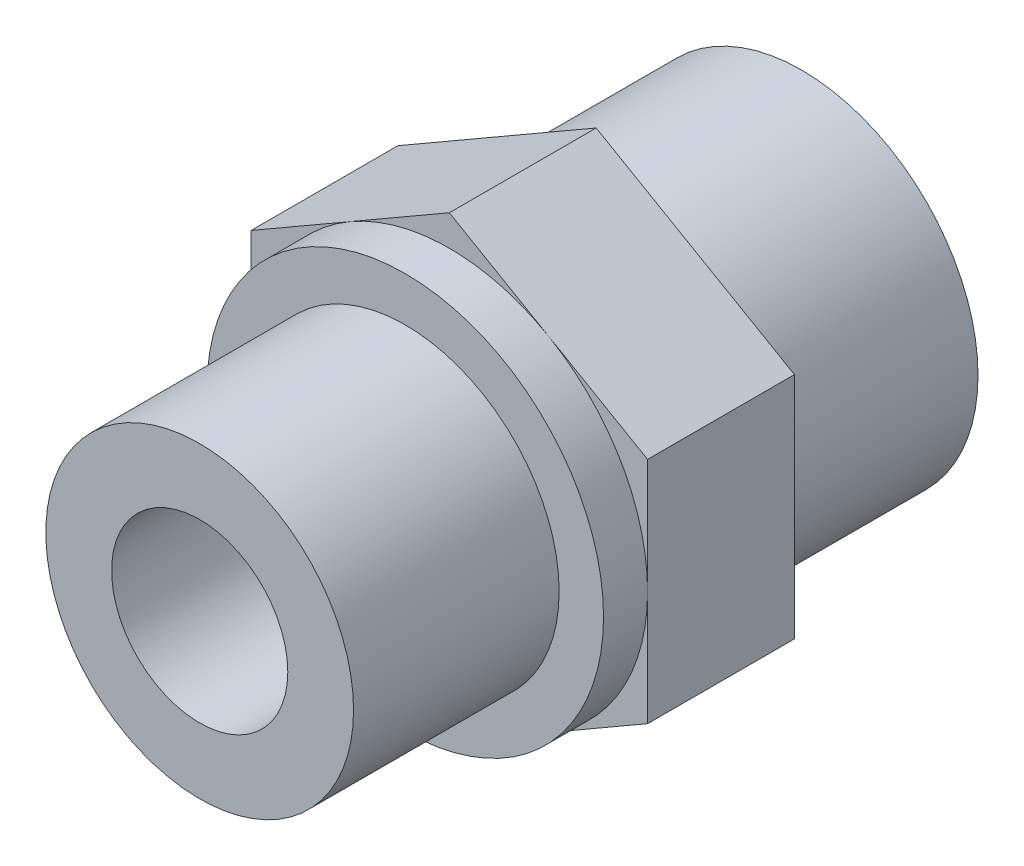
ISO-10303-21;
HEADER;
FILE_DESCRIPTION(('STEP AP214'),'2;1');
FILE_NAME('part.step','',(''),(''),'','','');
FILE_SCHEMA(('AUTOMOTIVE_DESIGN { 1 0 10303 214 1 1 1 1 }'));
ENDSEC;
DATA;
#1=APPLICATION_CONTEXT('core data for automotive mechanical design processes');
#2=APPLICATION_PROTOCOL_DEFINITION('international standard','automotive_design',2000,#1);
#3=PRODUCT_CONTEXT('',#1,'mechanical');
#4=PRODUCT('Part','Part','',(#3));
#5=PRODUCT_RELATED_PRODUCT_CATEGORY('part','',(#4));
#6=PRODUCT_DEFINITION_FORMATION('','',#4);
#7=PRODUCT_DEFINITION_CONTEXT('part definition',#1,'design');
#8=PRODUCT_DEFINITION('design','',#6,#7);
#9=PRODUCT_DEFINITION_SHAPE('','',#8);
#10=(LENGTH_UNIT() NAMED_UNIT(*) SI_UNIT(.MILLI.,.METRE.));
#11=(NAMED_UNIT(*) PLANE_ANGLE_UNIT() SI_UNIT($,.RADIAN.));
#12=(NAMED_UNIT(*) SI_UNIT($,.STERADIAN.) SOLID_ANGLE_UNIT());
#13=UNCERTAINTY_MEASURE_WITH_UNIT(LENGTH_MEASURE(1.E-05),#10,'distance_accuracy_value','');
#14=(GEOMETRIC_REPRESENTATION_CONTEXT(3) GLOBAL_UNCERTAINTY_ASSIGNED_CONTEXT((#13)) GLOBAL_UNIT_ASSIGNED_CONTEXT((#10,
#11,#12)) REPRESENTATION_CONTEXT('',''));
#15=CARTESIAN_POINT('',(0.,0.,0.));
#16=DIRECTION('',(0.,0.,1.));
#17=DIRECTION('',(1.,0.,0.));
#18=AXIS2_PLACEMENT_3D('',#15,#16,#17);
#19=CARTESIAN_POINT('',(0.,0.,-14.));
#20=DIRECTION('',(0.,0.,1.));
#21=DIRECTION('',(1.,0.,0.));
#22=AXIS2_PLACEMENT_3D('',#19,#20,#21);
#23=CYLINDRICAL_SURFACE('',#22,6.);
#24=CARTESIAN_POINT('',(0.,0.,27.));
#25=DIRECTION('',(0.,0.,1.));
#26=DIRECTION('',(1.,0.,0.));
#27=AXIS2_PLACEMENT_3D('',#24,#25,#26);
#28=CIRCLE('',#27,6.);
#29=CARTESIAN_POINT('',(6.,0.,27.));
#30=VERTEX_POINT('',#29);
#31=EDGE_CURVE('E530',#30,#30,#28,.T.);
#32=ORIENTED_EDGE('',*,*,#31,.T.);
#33=EDGE_LOOP('',(#32));
#34=FACE_BOUND('',#33,.T.);
#35=CARTESIAN_POINT('',(0.,0.,-5.5));
#36=DIRECTION('',(0.,0.,-1.));
#37=DIRECTION('',(-1.,0.,0.));
#38=AXIS2_PLACEMENT_3D('',#35,#36,#37);
#39=CIRCLE('',#38,6.);
#40=CARTESIAN_POINT('',(-6.,0.,-5.5));
#41=VERTEX_POINT('',#40);
#42=EDGE_CURVE('E47',#41,#41,#39,.F.);
#43=ORIENTED_EDGE('',*,*,#42,.F.);
#44=EDGE_LOOP('',(#43));
#45=FACE_BOUND('',#44,.T.);
#46=ADVANCED_FACE('F43',(#34,#45),#23,.F.);
#47=CARTESIAN_POINT('',(-13.5,23.3826859021798,10.));
#48=DIRECTION('',(0.,0.,1.));
#49=DIRECTION('',(1.,0.,0.));
#50=AXIS2_PLACEMENT_3D('',#47,#48,#49);
#51=PLANE('',#50);
#52=CARTESIAN_POINT('',(0.,0.,10.));
#53=DIRECTION('',(0.,0.,1.));
#54=DIRECTION('',(1.,0.,0.));
#55=AXIS2_PLACEMENT_3D('',#52,#53,#54);
#56=CIRCLE('',#55,13.5);
#57=CARTESIAN_POINT('',(13.5,0.,10.));
#58=VERTEX_POINT('',#57);
#59=CARTESIAN_POINT('',(6.75,11.6913429510899,10.));
#60=VERTEX_POINT('',#59);
#61=EDGE_CURVE('E133',#58,#60,#56,.T.);
#62=ORIENTED_EDGE('',*,*,#61,.F.);
#63=DIRECTION('',(0.,1.,0.));
#64=VECTOR('',#63,1.);
#65=CARTESIAN_POINT('',(13.5,-7.79422863405995,10.));
#66=LINE('',#65,#64);
#67=CARTESIAN_POINT('',(13.5,7.79422863405995,10.));
#68=VERTEX_POINT('',#67);
#69=EDGE_CURVE('E122',#58,#68,#66,.T.);
#70=ORIENTED_EDGE('',*,*,#69,.T.);
#71=DIRECTION('',(-0.866025403784439,0.5,0.));
#72=VECTOR('',#71,1.);
#73=CARTESIAN_POINT('',(13.5,7.79422863405995,10.));
#74=LINE('',#73,#72);
#75=EDGE_CURVE('E135',#68,#60,#74,.T.);
#76=ORIENTED_EDGE('',*,*,#75,.T.);
#77=EDGE_LOOP('',(#62,#70,#76));
#78=FACE_BOUND('',#77,.T.);
#79=ADVANCED_FACE('F134',(#78),#51,.T.);
#80=CARTESIAN_POINT('',(-6.75,11.6913429510899,10.));
#81=VERTEX_POINT('',#80);
#82=EDGE_CURVE('E52',#60,#81,#56,.T.);
#83=ORIENTED_EDGE('',*,*,#82,.F.);
#84=CARTESIAN_POINT('',(0.,15.5884572681199,10.));
#85=VERTEX_POINT('',#84);
#86=EDGE_CURVE('E153',#60,#85,#74,.T.);
#87=ORIENTED_EDGE('',*,*,#86,.T.);
#88=DIRECTION('',(-0.866025403784439,-0.5,0.));
#89=VECTOR('',#88,1.);
#90=CARTESIAN_POINT('',(0.,15.5884572681199,10.));
#91=LINE('',#90,#89);
#92=EDGE_CURVE('E154',#85,#81,#91,.T.);
#93=ORIENTED_EDGE('',*,*,#92,.T.);
#94=EDGE_LOOP('',(#83,#87,#93));
#95=FACE_BOUND('',#94,.T.);
#96=ADVANCED_FACE('F218',(#95),#51,.T.);
#97=CARTESIAN_POINT('',(-13.5,0.,10.));
#98=VERTEX_POINT('',#97);
#99=EDGE_CURVE('E215',#81,#98,#56,.T.);
#100=ORIENTED_EDGE('',*,*,#99,.F.);
#101=CARTESIAN_POINT('',(-13.5,7.79422863405995,10.));
#102=VERTEX_POINT('',#101);
#103=EDGE_CURVE('E152',#81,#102,#91,.T.);
#104=ORIENTED_EDGE('',*,*,#103,.T.);
#105=DIRECTION('',(0.,-1.,0.));
#106=VECTOR('',#105,1.);
#107=CARTESIAN_POINT('',(-13.5,7.79422863405995,10.));
#108=LINE('',#107,#106);
#109=EDGE_CURVE('E158',#102,#98,#108,.T.);
#110=ORIENTED_EDGE('',*,*,#109,.T.);
#111=EDGE_LOOP('',(#100,#104,#110));
#112=FACE_BOUND('',#111,.T.);
#113=ADVANCED_FACE('F224',(#112),#51,.T.);
#114=CARTESIAN_POINT('',(-6.75,-11.6913429510899,10.));
#115=VERTEX_POINT('',#114);
#116=EDGE_CURVE('E144',#98,#115,#56,.T.);
#117=ORIENTED_EDGE('',*,*,#116,.F.);
#118=CARTESIAN_POINT('',(-13.5,-7.79422863405994,10.));
#119=VERTEX_POINT('',#118);
#120=EDGE_CURVE('E157',#98,#119,#108,.T.);
#121=ORIENTED_EDGE('',*,*,#120,.T.);
#122=DIRECTION('',(0.866025403784439,-0.5,0.));
#123=VECTOR('',#122,1.);
#124=CARTESIAN_POINT('',(-13.5,-7.79422863405994,10.));
#125=LINE('',#124,#123);
#126=EDGE_CURVE('E162',#119,#115,#125,.T.);
#127=ORIENTED_EDGE('',*,*,#126,.T.);
#128=EDGE_LOOP('',(#117,#121,#127));
#129=FACE_BOUND('',#128,.T.);
#130=ADVANCED_FACE('F213',(#129),#51,.T.);
#131=CARTESIAN_POINT('',(6.74999999999999,-11.6913429510899,10.));
#132=VERTEX_POINT('',#131);
#133=EDGE_CURVE('E67',#115,#132,#56,.T.);
#134=ORIENTED_EDGE('',*,*,#133,.F.);
#135=CARTESIAN_POINT('',(0.,-15.5884572681199,10.));
#136=VERTEX_POINT('',#135);
#137=EDGE_CURVE('E161',#115,#136,#125,.T.);
#138=ORIENTED_EDGE('',*,*,#137,.T.);
#139=DIRECTION('',(0.866025403784439,0.5,0.));
#140=VECTOR('',#139,1.);
#141=CARTESIAN_POINT('',(0.,-15.5884572681199,10.));
#142=LINE('',#141,#140);
#143=EDGE_CURVE('E131',#136,#132,#142,.T.);
#144=ORIENTED_EDGE('',*,*,#143,.T.);
#145=EDGE_LOOP('',(#134,#138,#144));
#146=FACE_BOUND('',#145,.T.);
#147=ADVANCED_FACE('F211',(#146),#51,.T.);
#148=CARTESIAN_POINT('',(13.5,7.79422863405995,10.));
#149=DIRECTION('',(-0.5,-0.866025403784439,0.));
#150=DIRECTION('',(0.866025403784439,-0.5,0.));
#151=AXIS2_PLACEMENT_3D('',#148,#149,#150);
#152=PLANE('',#151);
#153=DIRECTION('',(-0.866025403784439,0.5,0.));
#154=VECTOR('',#153,1.);
#155=CARTESIAN_POINT('',(13.5,7.79422863405995,0.));
#156=LINE('',#155,#154);
#157=CARTESIAN_POINT('',(13.5,7.79422863405995,0.));
#158=VERTEX_POINT('',#157);
#159=CARTESIAN_POINT('',(0.,15.5884572681199,0.));
#160=VERTEX_POINT('',#159);
#161=EDGE_CURVE('E166',#158,#160,#156,.T.);
#162=ORIENTED_EDGE('',*,*,#161,.T.);
#163=DIRECTION('',(0.,0.,-1.));
#164=VECTOR('',#163,1.);
#165=CARTESIAN_POINT('',(0.,15.5884572681199,10.));
#166=LINE('',#165,#164);
#167=EDGE_CURVE('E143',#85,#160,#166,.T.);
#168=ORIENTED_EDGE('',*,*,#167,.F.);
#169=ORIENTED_EDGE('',*,*,#86,.F.);
#170=ORIENTED_EDGE('',*,*,#75,.F.);
#171=DIRECTION('',(0.,0.,-1.));
#172=VECTOR('',#171,1.);
#173=CARTESIAN_POINT('',(13.5,7.79422863405995,10.));
#174=LINE('',#173,#172);
#175=EDGE_CURVE('E121',#68,#158,#174,.T.);
#176=ORIENTED_EDGE('',*,*,#175,.T.);
#177=EDGE_LOOP('',(#162,#168,#169,#170,#176));
#178=FACE_BOUND('',#177,.T.);
#179=ADVANCED_FACE('F45',(#178),#152,.F.);
#180=CARTESIAN_POINT('',(0.,15.5884572681199,10.));
#181=DIRECTION('',(0.5,-0.866025403784439,0.));
#182=DIRECTION('',(0.866025403784439,0.5,0.));
#183=AXIS2_PLACEMENT_3D('',#180,#181,#182);
#184=PLANE('',#183);
#185=DIRECTION('',(-0.866025403784439,-0.5,0.));
#186=VECTOR('',#185,1.);
#187=CARTESIAN_POINT('',(0.,15.5884572681199,0.));
#188=LINE('',#187,#186);
#189=CARTESIAN_POINT('',(-13.5,7.79422863405995,0.));
#190=VERTEX_POINT('',#189);
#191=EDGE_CURVE('E169',#160,#190,#188,.T.);
#192=ORIENTED_EDGE('',*,*,#191,.T.);
#193=DIRECTION('',(0.,0.,-1.));
#194=VECTOR('',#193,1.);
#195=CARTESIAN_POINT('',(-13.5,7.79422863405995,10.));
#196=LINE('',#195,#194);
#197=EDGE_CURVE('E146',#102,#190,#196,.T.);
#198=ORIENTED_EDGE('',*,*,#197,.F.);
#199=ORIENTED_EDGE('',*,*,#103,.F.);
#200=ORIENTED_EDGE('',*,*,#92,.F.);
#201=ORIENTED_EDGE('',*,*,#167,.T.);
#202=EDGE_LOOP('',(#192,#198,#199,#200,#201));
#203=FACE_BOUND('',#202,.T.);
#204=ADVANCED_FACE('F222',(#203),#184,.F.);
#205=CARTESIAN_POINT('',(-13.5,7.79422863405995,10.));
#206=DIRECTION('',(1.,0.,0.));
#207=DIRECTION('',(0.,1.,0.));
#208=AXIS2_PLACEMENT_3D('',#205,#206,#207);
#209=PLANE('',#208);
#210=DIRECTION('',(0.,-1.,0.));
#211=VECTOR('',#210,1.);
#212=CARTESIAN_POINT('',(-13.5,7.79422863405995,0.));
#213=LINE('',#212,#211);
#214=CARTESIAN_POINT('',(-13.5,-7.79422863405994,0.));
#215=VERTEX_POINT('',#214);
#216=EDGE_CURVE('E171',#190,#215,#213,.T.);
#217=ORIENTED_EDGE('',*,*,#216,.T.);
#218=DIRECTION('',(0.,0.,-1.));
#219=VECTOR('',#218,1.);
#220=CARTESIAN_POINT('',(-13.5,-7.79422863405994,10.));
#221=LINE('',#220,#219);
#222=EDGE_CURVE('E185',#119,#215,#221,.T.);
#223=ORIENTED_EDGE('',*,*,#222,.F.);
#224=ORIENTED_EDGE('',*,*,#120,.F.);
#225=ORIENTED_EDGE('',*,*,#109,.F.);
#226=ORIENTED_EDGE('',*,*,#197,.T.);
#227=EDGE_LOOP('',(#217,#223,#224,#225,#226));
#228=FACE_BOUND('',#227,.T.);
#229=ADVANCED_FACE('F193',(#228),#209,.F.);
#230=CARTESIAN_POINT('',(-13.5,-7.79422863405994,10.));
#231=DIRECTION('',(0.5,0.866025403784439,0.));
#232=DIRECTION('',(-0.866025403784439,0.5,0.));
#233=AXIS2_PLACEMENT_3D('',#230,#231,#232);
#234=PLANE('',#233);
#235=DIRECTION('',(0.866025403784439,-0.5,0.));
#236=VECTOR('',#235,1.);
#237=CARTESIAN_POINT('',(-13.5,-7.79422863405994,0.));
#238=LINE('',#237,#236);
#239=CARTESIAN_POINT('',(0.,-15.5884572681199,0.));
#240=VERTEX_POINT('',#239);
#241=EDGE_CURVE('E173',#215,#240,#238,.T.);
#242=ORIENTED_EDGE('',*,*,#241,.T.);
#243=DIRECTION('',(0.,0.,-1.));
#244=VECTOR('',#243,1.);
#245=CARTESIAN_POINT('',(0.,-15.5884572681199,10.));
#246=LINE('',#245,#244);
#247=EDGE_CURVE('E182',#136,#240,#246,.T.);
#248=ORIENTED_EDGE('',*,*,#247,.F.);
#249=ORIENTED_EDGE('',*,*,#137,.F.);
#250=ORIENTED_EDGE('',*,*,#126,.F.);
#251=ORIENTED_EDGE('',*,*,#222,.T.);
#252=EDGE_LOOP('',(#242,#248,#249,#250,#251));
#253=FACE_BOUND('',#252,.T.);
#254=ADVANCED_FACE('F206',(#253),#234,.F.);
#255=CARTESIAN_POINT('',(0.,-15.5884572681199,10.));
#256=DIRECTION('',(-0.5,0.866025403784439,0.));
#257=DIRECTION('',(-0.866025403784439,-0.5,0.));
#258=AXIS2_PLACEMENT_3D('',#255,#256,#257);
#259=PLANE('',#258);
#260=DIRECTION('',(0.866025403784439,0.5,0.));
#261=VECTOR('',#260,1.);
#262=CARTESIAN_POINT('',(0.,-15.5884572681199,0.));
#263=LINE('',#262,#261);
#264=CARTESIAN_POINT('',(13.5,-7.79422863405995,0.));
#265=VERTEX_POINT('',#264);
#266=EDGE_CURVE('E175',#240,#265,#263,.T.);
#267=ORIENTED_EDGE('',*,*,#266,.T.);
#268=DIRECTION('',(0.,0.,-1.));
#269=VECTOR('',#268,1.);
#270=CARTESIAN_POINT('',(13.5,-7.79422863405995,10.));
#271=LINE('',#270,#269);
#272=CARTESIAN_POINT('',(13.5,-7.79422863405995,10.));
#273=VERTEX_POINT('',#272);
#274=EDGE_CURVE('E180',#273,#265,#271,.T.);
#275=ORIENTED_EDGE('',*,*,#274,.F.);
#276=EDGE_CURVE('E117',#132,#273,#142,.T.);
#277=ORIENTED_EDGE('',*,*,#276,.F.);
#278=ORIENTED_EDGE('',*,*,#143,.F.);
#279=ORIENTED_EDGE('',*,*,#247,.T.);
#280=EDGE_LOOP('',(#267,#275,#277,#278,#279));
#281=FACE_BOUND('',#280,.T.);
#282=ADVANCED_FACE('F210',(#281),#259,.F.);
#283=CARTESIAN_POINT('',(13.5,-7.79422863405995,10.));
#284=DIRECTION('',(-1.,0.,0.));
#285=DIRECTION('',(0.,-1.,0.));
#286=AXIS2_PLACEMENT_3D('',#283,#284,#285);
#287=PLANE('',#286);
#288=DIRECTION('',(0.,1.,0.));
#289=VECTOR('',#288,1.);
#290=CARTESIAN_POINT('',(13.5,-7.79422863405995,0.));
#291=LINE('',#290,#289);
#292=EDGE_CURVE('E177',#265,#158,#291,.T.);
#293=ORIENTED_EDGE('',*,*,#292,.T.);
#294=ORIENTED_EDGE('',*,*,#175,.F.);
#295=ORIENTED_EDGE('',*,*,#69,.F.);
#296=EDGE_CURVE('E114',#273,#58,#66,.T.);
#297=ORIENTED_EDGE('',*,*,#296,.F.);
#298=ORIENTED_EDGE('',*,*,#274,.T.);
#299=EDGE_LOOP('',(#293,#294,#295,#297,#298));
#300=FACE_BOUND('',#299,.T.);
#301=ADVANCED_FACE('F126',(#300),#287,.F.);
#302=EDGE_CURVE('E59',#132,#58,#56,.T.);
#303=ORIENTED_EDGE('',*,*,#302,.F.);
#304=ORIENTED_EDGE('',*,*,#276,.T.);
#305=ORIENTED_EDGE('',*,*,#296,.T.);
#306=EDGE_LOOP('',(#303,#304,#305));
#307=FACE_BOUND('',#306,.T.);
#308=ADVANCED_FACE('F116',(#307),#51,.T.);
#309=CARTESIAN_POINT('',(-13.5,23.3826859021798,0.));
#310=DIRECTION('',(0.,0.,1.));
#311=DIRECTION('',(1.,0.,0.));
#312=AXIS2_PLACEMENT_3D('',#309,#310,#311);
#313=PLANE('',#312);
#314=CARTESIAN_POINT('',(0.,0.,0.));
#315=DIRECTION('',(0.,0.,1.));
#316=DIRECTION('',(1.,0.,0.));
#317=AXIS2_PLACEMENT_3D('',#314,#315,#316);
#318=CIRCLE('',#317,12.);
#319=CARTESIAN_POINT('',(12.,0.,0.));
#320=VERTEX_POINT('',#319);
#321=EDGE_CURVE('E11',#320,#320,#318,.F.);
#322=ORIENTED_EDGE('',*,*,#321,.F.);
#323=EDGE_LOOP('',(#322));
#324=FACE_BOUND('',#323,.T.);
#325=ORIENTED_EDGE('',*,*,#161,.F.);
#326=ORIENTED_EDGE('',*,*,#292,.F.);
#327=ORIENTED_EDGE('',*,*,#266,.F.);
#328=ORIENTED_EDGE('',*,*,#241,.F.);
#329=ORIENTED_EDGE('',*,*,#216,.F.);
#330=ORIENTED_EDGE('',*,*,#191,.F.);
#331=EDGE_LOOP('',(#325,#326,#327,#328,#329,#330));
#332=FACE_BOUND('',#331,.T.);
#333=ADVANCED_FACE('F201',(#324,#332),#313,.F.);
#334=CARTESIAN_POINT('',(0.,0.,13.));
#335=DIRECTION('',(0.,0.,-1.));
#336=DIRECTION('',(-1.,0.,0.));
#337=AXIS2_PLACEMENT_3D('',#334,#335,#336);
#338=CYLINDRICAL_SURFACE('',#337,13.5);
#339=CARTESIAN_POINT('',(0.,0.,13.));
#340=DIRECTION('',(0.,0.,1.));
#341=DIRECTION('',(1.,0.,0.));
#342=AXIS2_PLACEMENT_3D('',#339,#340,#341);
#343=CIRCLE('',#342,13.5);
#344=CARTESIAN_POINT('',(13.5,0.,13.));
#345=VERTEX_POINT('',#344);
#346=EDGE_CURVE('E138',#345,#345,#343,.T.);
#347=ORIENTED_EDGE('',*,*,#346,.F.);
#348=EDGE_LOOP('',(#347));
#349=FACE_BOUND('',#348,.T.);
#350=ORIENTED_EDGE('',*,*,#61,.T.);
#351=ORIENTED_EDGE('',*,*,#82,.T.);
#352=ORIENTED_EDGE('',*,*,#99,.T.);
#353=ORIENTED_EDGE('',*,*,#116,.T.);
#354=ORIENTED_EDGE('',*,*,#133,.T.);
#355=ORIENTED_EDGE('',*,*,#302,.T.);
#356=EDGE_LOOP('',(#350,#351,#352,#353,#354,#355));
#357=FACE_BOUND('',#356,.T.);
#358=ADVANCED_FACE('F141',(#349,#357),#338,.T.);
#359=CARTESIAN_POINT('',(0.,0.,13.));
#360=DIRECTION('',(0.,0.,1.));
#361=DIRECTION('',(1.,0.,0.));
#362=AXIS2_PLACEMENT_3D('',#359,#360,#361);
#363=PLANE('',#362);
#364=CARTESIAN_POINT('',(0.,0.,13.));
#365=DIRECTION('',(0.,0.,1.));
#366=DIRECTION('',(1.,0.,0.));
#367=AXIS2_PLACEMENT_3D('',#364,#365,#366);
#368=CIRCLE('',#367,10.4775);
#369=CARTESIAN_POINT('',(10.4775,0.,13.));
#370=VERTEX_POINT('',#369);
#371=EDGE_CURVE('E535',#370,#370,#368,.T.);
#372=ORIENTED_EDGE('',*,*,#371,.F.);
#373=EDGE_LOOP('',(#372));
#374=FACE_BOUND('',#373,.T.);
#375=ORIENTED_EDGE('',*,*,#346,.T.);
#376=EDGE_LOOP('',(#375));
#377=FACE_BOUND('',#376,.T.);
#378=ADVANCED_FACE('F261',(#374,#377),#363,.T.);
#379=CARTESIAN_POINT('',(0.,0.,27.));
#380=DIRECTION('',(0.,0.,-1.));
#381=DIRECTION('',(-1.,0.,0.));
#382=AXIS2_PLACEMENT_3D('',#379,#380,#381);
#383=CYLINDRICAL_SURFACE('',#382,10.4775);
#384=CARTESIAN_POINT('',(0.,0.,27.));
#385=DIRECTION('',(0.,0.,1.));
#386=DIRECTION('',(1.,0.,0.));
#387=AXIS2_PLACEMENT_3D('',#384,#385,#386);
#388=CIRCLE('',#387,10.4775);
#389=CARTESIAN_POINT('',(10.4775,0.,27.));
#390=VERTEX_POINT('',#389);
#391=EDGE_CURVE('E139',#390,#390,#388,.T.);
#392=ORIENTED_EDGE('',*,*,#391,.F.);
#393=EDGE_LOOP('',(#392));
#394=FACE_BOUND('',#393,.T.);
#395=ORIENTED_EDGE('',*,*,#371,.T.);
#396=EDGE_LOOP('',(#395));
#397=FACE_BOUND('',#396,.T.);
#398=ADVANCED_FACE('F257',(#394,#397),#383,.T.);
#399=CARTESIAN_POINT('',(0.,0.,27.));
#400=DIRECTION('',(0.,0.,1.));
#401=DIRECTION('',(1.,0.,0.));
#402=AXIS2_PLACEMENT_3D('',#399,#400,#401);
#403=PLANE('',#402);
#404=ORIENTED_EDGE('',*,*,#31,.F.);
#405=EDGE_LOOP('',(#404));
#406=FACE_BOUND('',#405,.T.);
#407=ORIENTED_EDGE('',*,*,#391,.T.);
#408=EDGE_LOOP('',(#407));
#409=FACE_BOUND('',#408,.T.);
#410=ADVANCED_FACE('F253',(#406,#409),#403,.T.);
#411=CARTESIAN_POINT('',(0.,0.,-14.));
#412=DIRECTION('',(0.,0.,1.));
#413=DIRECTION('',(1.,0.,0.));
#414=AXIS2_PLACEMENT_3D('',#411,#412,#413);
#415=CYLINDRICAL_SURFACE('',#414,12.);
#416=CARTESIAN_POINT('',(0.,0.,-14.));
#417=DIRECTION('',(0.,0.,-1.));
#418=DIRECTION('',(-1.,0.,0.));
#419=AXIS2_PLACEMENT_3D('',#416,#417,#418);
#420=CIRCLE('',#419,12.);
#421=CARTESIAN_POINT('',(-12.,0.,-14.));
#422=VERTEX_POINT('',#421);
#423=EDGE_CURVE('E532',#422,#422,#420,.T.);
#424=ORIENTED_EDGE('',*,*,#423,.F.);
#425=EDGE_LOOP('',(#424));
#426=FACE_BOUND('',#425,.T.);
#427=ORIENTED_EDGE('',*,*,#321,.T.);
#428=EDGE_LOOP('',(#427));
#429=FACE_BOUND('',#428,.T.);
#430=ADVANCED_FACE('F249',(#426,#429),#415,.T.);
#431=CARTESIAN_POINT('',(0.,0.,-14.));
#432=DIRECTION('',(0.,0.,-1.));
#433=DIRECTION('',(-1.,0.,0.));
#434=AXIS2_PLACEMENT_3D('',#431,#432,#433);
#435=PLANE('',#434);
#436=CARTESIAN_POINT('',(0.,0.,-14.));
#437=DIRECTION('',(0.,0.,1.));
#438=DIRECTION('',(1.,0.,0.));
#439=AXIS2_PLACEMENT_3D('',#436,#437,#438);
#440=CIRCLE('',#439,9.15);
#441=CARTESIAN_POINT('',(9.15,0.,-14.));
#442=VERTEX_POINT('',#441);
#443=EDGE_CURVE('E524',#442,#442,#440,.T.);
#444=ORIENTED_EDGE('',*,*,#443,.T.);
#445=EDGE_LOOP('',(#444));
#446=FACE_BOUND('',#445,.T.);
#447=ORIENTED_EDGE('',*,*,#423,.T.);
#448=EDGE_LOOP('',(#447));
#449=FACE_BOUND('',#448,.T.);
#450=ADVANCED_FACE('F245',(#446,#449),#435,.T.);
#451=CARTESIAN_POINT('',(0.,8.,-5.5));
#452=DIRECTION('',(0.,0.,-1.));
#453=DIRECTION('',(-1.,0.,0.));
#454=AXIS2_PLACEMENT_3D('',#451,#452,#453);
#455=PLANE('',#454);
#456=CARTESIAN_POINT('',(0.,0.,-5.5));
#457=DIRECTION('',(0.,0.,1.));
#458=DIRECTION('',(1.,0.,0.));
#459=AXIS2_PLACEMENT_3D('',#456,#457,#458);
#460=CIRCLE('',#459,8.);
#461=CARTESIAN_POINT('',(8.,0.,-5.5));
#462=VERTEX_POINT('',#461);
#463=EDGE_CURVE('E520',#462,#462,#460,.T.);
#464=ORIENTED_EDGE('',*,*,#463,.F.);
#465=EDGE_LOOP('',(#464));
#466=FACE_BOUND('',#465,.T.);
#467=ORIENTED_EDGE('',*,*,#42,.T.);
#468=EDGE_LOOP('',(#467));
#469=FACE_BOUND('',#468,.T.);
#470=ADVANCED_FACE('F248',(#466,#469),#455,.T.);
#471=CARTESIAN_POINT('',(0.,0.,-14.));
#472=DIRECTION('',(0.,0.,-1.));
#473=DIRECTION('',(-1.,0.,0.));
#474=AXIS2_PLACEMENT_3D('',#471,#472,#473);
#475=CONICAL_SURFACE('',#474,9.15,0.209439510239313);
#476=CARTESIAN_POINT('',(0.,0.,-8.5896753740996));
#477=DIRECTION('',(0.,0.,1.));
#478=DIRECTION('',(1.,0.,0.));
#479=AXIS2_PLACEMENT_3D('',#476,#477,#478);
#480=CIRCLE('',#479,8.);
#481=CARTESIAN_POINT('',(8.,0.,-8.5896753740996));
#482=VERTEX_POINT('',#481);
#483=EDGE_CURVE('E523',#482,#482,#480,.T.);
#484=ORIENTED_EDGE('',*,*,#483,.T.);
#485=EDGE_LOOP('',(#484));
#486=FACE_BOUND('',#485,.T.);
#487=ORIENTED_EDGE('',*,*,#443,.F.);
#488=EDGE_LOOP('',(#487));
#489=FACE_BOUND('',#488,.T.);
#490=ADVANCED_FACE('F243',(#486,#489),#475,.F.);
#491=CARTESIAN_POINT('',(0.,0.,0.));
#492=DIRECTION('',(0.,0.,1.));
#493=DIRECTION('',(1.,0.,0.));
#494=AXIS2_PLACEMENT_3D('',#491,#492,#493);
#495=CYLINDRICAL_SURFACE('',#494,8.);
#496=ORIENTED_EDGE('',*,*,#463,.T.);
#497=EDGE_LOOP('',(#496));
#498=FACE_BOUND('',#497,.T.);
#499=ORIENTED_EDGE('',*,*,#483,.F.);
#500=EDGE_LOOP('',(#499));
#501=FACE_BOUND('',#500,.T.);
#502=ADVANCED_FACE('F357',(#498,#501),#495,.F.);
#503=CLOSED_SHELL('',(#46,#79,#96,#113,#130,#147,#179,#204,#229,#254,#282,#301,#308,#333,#358,
#378,#398,#410,#430,#450,#470,#490,#502));
#504=MANIFOLD_SOLID_BREP('B2',#503);
#505=ADVANCED_BREP_SHAPE_REPRESENTATION('',(#18,#504),#14);
#506=SHAPE_DEFINITION_REPRESENTATION(#9,#505);
ENDSEC;
END-ISO-10303-21;
